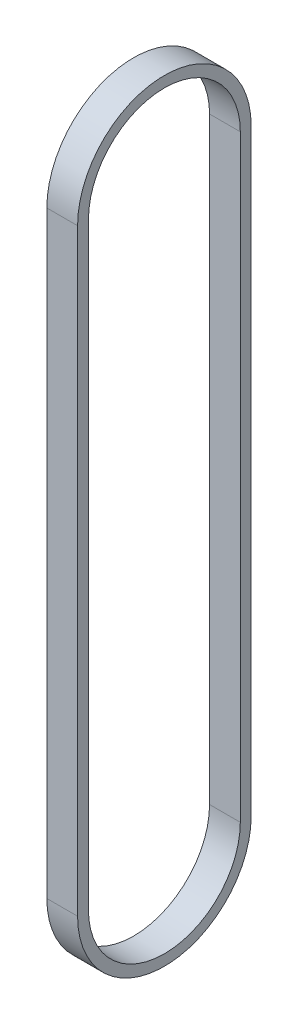
ISO-10303-21;
HEADER;
FILE_DESCRIPTION(('STEP AP214'),'2;1');
FILE_NAME('part.step','',(''),(''),'','','');
FILE_SCHEMA(('AUTOMOTIVE_DESIGN { 1 0 10303 214 1 1 1 1 }'));
ENDSEC;
DATA;
#1=APPLICATION_CONTEXT('core data for automotive mechanical design processes');
#2=APPLICATION_PROTOCOL_DEFINITION('international standard','automotive_design',2000,#1);
#3=PRODUCT_CONTEXT('',#1,'mechanical');
#4=PRODUCT('Part','Part','',(#3));
#5=PRODUCT_RELATED_PRODUCT_CATEGORY('part','',(#4));
#6=PRODUCT_DEFINITION_FORMATION('','',#4);
#7=PRODUCT_DEFINITION_CONTEXT('part definition',#1,'design');
#8=PRODUCT_DEFINITION('design','',#6,#7);
#9=PRODUCT_DEFINITION_SHAPE('','',#8);
#10=(LENGTH_UNIT() NAMED_UNIT(*) SI_UNIT(.MILLI.,.METRE.));
#11=(NAMED_UNIT(*) PLANE_ANGLE_UNIT() SI_UNIT($,.RADIAN.));
#12=(NAMED_UNIT(*) SI_UNIT($,.STERADIAN.) SOLID_ANGLE_UNIT());
#13=UNCERTAINTY_MEASURE_WITH_UNIT(LENGTH_MEASURE(1.E-05),#10,'distance_accuracy_value','');
#14=(GEOMETRIC_REPRESENTATION_CONTEXT(3) GLOBAL_UNCERTAINTY_ASSIGNED_CONTEXT((#13)) GLOBAL_UNIT_ASSIGNED_CONTEXT((#10,
#11,#12)) REPRESENTATION_CONTEXT('',''));
#15=CARTESIAN_POINT('',(0.,0.,0.));
#16=DIRECTION('',(0.,0.,1.));
#17=DIRECTION('',(1.,0.,0.));
#18=AXIS2_PLACEMENT_3D('',#15,#16,#17);
#19=CARTESIAN_POINT('',(9.,175.02378,0.));
#20=DIRECTION('',(-1.,0.,0.));
#21=DIRECTION('',(0.,0.,1.));
#22=AXIS2_PLACEMENT_3D('',#19,#20,#21);
#23=PLANE('',#22);
#24=CARTESIAN_POINT('',(9.,175.02378,0.));
#25=DIRECTION('',(1.,0.,0.));
#26=DIRECTION('',(0.,0.,1.));
#27=AXIS2_PLACEMENT_3D('',#24,#25,#26);
#28=CIRCLE('',#27,25.4);
#29=CARTESIAN_POINT('',(9.,175.02378,-25.4));
#30=VERTEX_POINT('',#29);
#31=CARTESIAN_POINT('',(9.,175.02378,25.4));
#32=VERTEX_POINT('',#31);
#33=EDGE_CURVE('E133',#30,#32,#28,.T.);
#34=ORIENTED_EDGE('',*,*,#33,.T.);
#35=DIRECTION('',(0.,-1.,0.));
#36=VECTOR('',#35,1.);
#37=CARTESIAN_POINT('',(9.,0.,25.4));
#38=LINE('',#37,#36);
#39=CARTESIAN_POINT('',(9.,0.,25.4));
#40=VERTEX_POINT('',#39);
#41=EDGE_CURVE('E136',#32,#40,#38,.T.);
#42=ORIENTED_EDGE('',*,*,#41,.T.);
#43=CARTESIAN_POINT('',(9.,0.,0.));
#44=DIRECTION('',(1.,0.,0.));
#45=DIRECTION('',(0.,0.,-1.));
#46=AXIS2_PLACEMENT_3D('',#43,#44,#45);
#47=CIRCLE('',#46,25.4);
#48=CARTESIAN_POINT('',(9.,0.,-25.4));
#49=VERTEX_POINT('',#48);
#50=EDGE_CURVE('E139',#40,#49,#47,.T.);
#51=ORIENTED_EDGE('',*,*,#50,.T.);
#52=DIRECTION('',(0.,1.,0.));
#53=VECTOR('',#52,1.);
#54=CARTESIAN_POINT('',(9.,175.02378,-25.4));
#55=LINE('',#54,#53);
#56=EDGE_CURVE('E141',#49,#30,#55,.T.);
#57=ORIENTED_EDGE('',*,*,#56,.T.);
#58=EDGE_LOOP('',(#34,#42,#51,#57));
#59=FACE_BOUND('',#58,.T.);
#60=CARTESIAN_POINT('',(9.,175.02378,0.));
#61=DIRECTION('',(1.,0.,0.));
#62=DIRECTION('',(0.,0.,1.));
#63=AXIS2_PLACEMENT_3D('',#60,#61,#62);
#64=CIRCLE('',#63,22.225);
#65=CARTESIAN_POINT('',(9.,175.02378,-22.225));
#66=VERTEX_POINT('',#65);
#67=CARTESIAN_POINT('',(9.,175.02378,22.225));
#68=VERTEX_POINT('',#67);
#69=EDGE_CURVE('E97',#66,#68,#64,.T.);
#70=ORIENTED_EDGE('',*,*,#69,.F.);
#71=DIRECTION('',(0.,1.,0.));
#72=VECTOR('',#71,1.);
#73=CARTESIAN_POINT('',(9.,175.02378,-22.225));
#74=LINE('',#73,#72);
#75=CARTESIAN_POINT('',(9.,0.,-22.2250000000001));
#76=VERTEX_POINT('',#75);
#77=EDGE_CURVE('E119',#76,#66,#74,.T.);
#78=ORIENTED_EDGE('',*,*,#77,.F.);
#79=CARTESIAN_POINT('',(9.,0.,0.));
#80=DIRECTION('',(1.,0.,0.));
#81=DIRECTION('',(0.,0.,-1.));
#82=AXIS2_PLACEMENT_3D('',#79,#80,#81);
#83=CIRCLE('',#82,22.225);
#84=CARTESIAN_POINT('',(9.,0.,22.225));
#85=VERTEX_POINT('',#84);
#86=EDGE_CURVE('E117',#85,#76,#83,.T.);
#87=ORIENTED_EDGE('',*,*,#86,.F.);
#88=DIRECTION('',(0.,-1.,0.));
#89=VECTOR('',#88,1.);
#90=CARTESIAN_POINT('',(9.,0.,22.225));
#91=LINE('',#90,#89);
#92=EDGE_CURVE('E105',#68,#85,#91,.T.);
#93=ORIENTED_EDGE('',*,*,#92,.F.);
#94=EDGE_LOOP('',(#70,#78,#87,#93));
#95=FACE_BOUND('',#94,.T.);
#96=ADVANCED_FACE('F32',(#59,#95),#23,.F.);
#97=CARTESIAN_POINT('',(0.,175.02378,0.));
#98=DIRECTION('',(-1.,0.,0.));
#99=DIRECTION('',(0.,0.,1.));
#100=AXIS2_PLACEMENT_3D('',#97,#98,#99);
#101=PLANE('',#100);
#102=CARTESIAN_POINT('',(0.,175.02378,0.));
#103=DIRECTION('',(1.,0.,0.));
#104=DIRECTION('',(0.,0.,1.));
#105=AXIS2_PLACEMENT_3D('',#102,#103,#104);
#106=CIRCLE('',#105,25.4);
#107=CARTESIAN_POINT('',(0.,175.02378,-25.4));
#108=VERTEX_POINT('',#107);
#109=CARTESIAN_POINT('',(0.,175.02378,25.4));
#110=VERTEX_POINT('',#109);
#111=EDGE_CURVE('E113',#108,#110,#106,.T.);
#112=ORIENTED_EDGE('',*,*,#111,.F.);
#113=DIRECTION('',(0.,1.,0.));
#114=VECTOR('',#113,1.);
#115=CARTESIAN_POINT('',(0.,175.02378,-25.4));
#116=LINE('',#115,#114);
#117=CARTESIAN_POINT('',(0.,0.,-25.4));
#118=VERTEX_POINT('',#117);
#119=EDGE_CURVE('E137',#118,#108,#116,.T.);
#120=ORIENTED_EDGE('',*,*,#119,.F.);
#121=CARTESIAN_POINT('',(0.,0.,0.));
#122=DIRECTION('',(1.,0.,0.));
#123=DIRECTION('',(0.,0.,-1.));
#124=AXIS2_PLACEMENT_3D('',#121,#122,#123);
#125=CIRCLE('',#124,25.4);
#126=CARTESIAN_POINT('',(0.,0.,25.4));
#127=VERTEX_POINT('',#126);
#128=EDGE_CURVE('E148',#127,#118,#125,.T.);
#129=ORIENTED_EDGE('',*,*,#128,.F.);
#130=DIRECTION('',(0.,-1.,0.));
#131=VECTOR('',#130,1.);
#132=CARTESIAN_POINT('',(0.,0.,25.4));
#133=LINE('',#132,#131);
#134=EDGE_CURVE('E146',#110,#127,#133,.T.);
#135=ORIENTED_EDGE('',*,*,#134,.F.);
#136=EDGE_LOOP('',(#112,#120,#129,#135));
#137=FACE_BOUND('',#136,.T.);
#138=DIRECTION('',(0.,1.,0.));
#139=VECTOR('',#138,1.);
#140=CARTESIAN_POINT('',(0.,175.02378,-22.225));
#141=LINE('',#140,#139);
#142=CARTESIAN_POINT('',(0.,0.,-22.2250000000001));
#143=VERTEX_POINT('',#142);
#144=CARTESIAN_POINT('',(0.,175.02378,-22.225));
#145=VERTEX_POINT('',#144);
#146=EDGE_CURVE('E106',#143,#145,#141,.T.);
#147=ORIENTED_EDGE('',*,*,#146,.T.);
#148=CARTESIAN_POINT('',(0.,175.02378,0.));
#149=DIRECTION('',(1.,0.,0.));
#150=DIRECTION('',(0.,0.,1.));
#151=AXIS2_PLACEMENT_3D('',#148,#149,#150);
#152=CIRCLE('',#151,22.225);
#153=CARTESIAN_POINT('',(0.,175.02378,22.225));
#154=VERTEX_POINT('',#153);
#155=EDGE_CURVE('E55',#145,#154,#152,.T.);
#156=ORIENTED_EDGE('',*,*,#155,.T.);
#157=DIRECTION('',(0.,-1.,0.));
#158=VECTOR('',#157,1.);
#159=CARTESIAN_POINT('',(0.,0.,22.225));
#160=LINE('',#159,#158);
#161=CARTESIAN_POINT('',(0.,0.,22.225));
#162=VERTEX_POINT('',#161);
#163=EDGE_CURVE('E112',#154,#162,#160,.T.);
#164=ORIENTED_EDGE('',*,*,#163,.T.);
#165=CARTESIAN_POINT('',(0.,0.,0.));
#166=DIRECTION('',(1.,0.,0.));
#167=DIRECTION('',(0.,0.,-1.));
#168=AXIS2_PLACEMENT_3D('',#165,#166,#167);
#169=CIRCLE('',#168,22.225);
#170=EDGE_CURVE('E125',#162,#143,#169,.T.);
#171=ORIENTED_EDGE('',*,*,#170,.T.);
#172=EDGE_LOOP('',(#147,#156,#164,#171));
#173=FACE_BOUND('',#172,.T.);
#174=ADVANCED_FACE('F166',(#137,#173),#101,.T.);
#175=CARTESIAN_POINT('',(9.,175.02378,0.));
#176=DIRECTION('',(-1.,0.,0.));
#177=DIRECTION('',(0.,0.,1.));
#178=AXIS2_PLACEMENT_3D('',#175,#176,#177);
#179=CYLINDRICAL_SURFACE('',#178,25.4);
#180=ORIENTED_EDGE('',*,*,#111,.T.);
#181=DIRECTION('',(-1.,0.,0.));
#182=VECTOR('',#181,1.);
#183=CARTESIAN_POINT('',(9.,175.02378,25.4));
#184=LINE('',#183,#182);
#185=EDGE_CURVE('E11',#32,#110,#184,.T.);
#186=ORIENTED_EDGE('',*,*,#185,.F.);
#187=ORIENTED_EDGE('',*,*,#33,.F.);
#188=DIRECTION('',(-1.,0.,0.));
#189=VECTOR('',#188,1.);
#190=CARTESIAN_POINT('',(9.,175.02378,-25.4));
#191=LINE('',#190,#189);
#192=EDGE_CURVE('E143',#30,#108,#191,.T.);
#193=ORIENTED_EDGE('',*,*,#192,.T.);
#194=EDGE_LOOP('',(#180,#186,#187,#193));
#195=FACE_BOUND('',#194,.T.);
#196=ADVANCED_FACE('F34',(#195),#179,.T.);
#197=CARTESIAN_POINT('',(9.,0.,25.4));
#198=DIRECTION('',(0.,0.,-1.));
#199=DIRECTION('',(-1.,0.,0.));
#200=AXIS2_PLACEMENT_3D('',#197,#198,#199);
#201=PLANE('',#200);
#202=ORIENTED_EDGE('',*,*,#134,.T.);
#203=DIRECTION('',(-1.,0.,0.));
#204=VECTOR('',#203,1.);
#205=CARTESIAN_POINT('',(9.,0.,25.4));
#206=LINE('',#205,#204);
#207=EDGE_CURVE('E40',#40,#127,#206,.T.);
#208=ORIENTED_EDGE('',*,*,#207,.F.);
#209=ORIENTED_EDGE('',*,*,#41,.F.);
#210=ORIENTED_EDGE('',*,*,#185,.T.);
#211=EDGE_LOOP('',(#202,#208,#209,#210));
#212=FACE_BOUND('',#211,.T.);
#213=ADVANCED_FACE('F176',(#212),#201,.F.);
#214=CARTESIAN_POINT('',(9.,0.,0.));
#215=DIRECTION('',(-1.,0.,0.));
#216=DIRECTION('',(0.,0.,1.));
#217=AXIS2_PLACEMENT_3D('',#214,#215,#216);
#218=CYLINDRICAL_SURFACE('',#217,25.4);
#219=ORIENTED_EDGE('',*,*,#128,.T.);
#220=DIRECTION('',(-1.,0.,0.));
#221=VECTOR('',#220,1.);
#222=CARTESIAN_POINT('',(9.,0.,-25.4));
#223=LINE('',#222,#221);
#224=EDGE_CURVE('E153',#49,#118,#223,.T.);
#225=ORIENTED_EDGE('',*,*,#224,.F.);
#226=ORIENTED_EDGE('',*,*,#50,.F.);
#227=ORIENTED_EDGE('',*,*,#207,.T.);
#228=EDGE_LOOP('',(#219,#225,#226,#227));
#229=FACE_BOUND('',#228,.T.);
#230=ADVANCED_FACE('F160',(#229),#218,.T.);
#231=CARTESIAN_POINT('',(9.,175.02378,-25.4));
#232=DIRECTION('',(0.,0.,1.));
#233=DIRECTION('',(0.,-1.,0.));
#234=AXIS2_PLACEMENT_3D('',#231,#232,#233);
#235=PLANE('',#234);
#236=ORIENTED_EDGE('',*,*,#119,.T.);
#237=ORIENTED_EDGE('',*,*,#192,.F.);
#238=ORIENTED_EDGE('',*,*,#56,.F.);
#239=ORIENTED_EDGE('',*,*,#224,.T.);
#240=EDGE_LOOP('',(#236,#237,#238,#239));
#241=FACE_BOUND('',#240,.T.);
#242=ADVANCED_FACE('F170',(#241),#235,.F.);
#243=CARTESIAN_POINT('',(9.,175.02378,0.));
#244=DIRECTION('',(-1.,0.,0.));
#245=DIRECTION('',(0.,0.,1.));
#246=AXIS2_PLACEMENT_3D('',#243,#244,#245);
#247=CYLINDRICAL_SURFACE('',#246,22.225);
#248=ORIENTED_EDGE('',*,*,#155,.F.);
#249=DIRECTION('',(-1.,0.,0.));
#250=VECTOR('',#249,1.);
#251=CARTESIAN_POINT('',(9.,175.02378,-22.225));
#252=LINE('',#251,#250);
#253=EDGE_CURVE('E101',#66,#145,#252,.T.);
#254=ORIENTED_EDGE('',*,*,#253,.F.);
#255=ORIENTED_EDGE('',*,*,#69,.T.);
#256=DIRECTION('',(-1.,0.,0.));
#257=VECTOR('',#256,1.);
#258=CARTESIAN_POINT('',(9.,175.02378,22.225));
#259=LINE('',#258,#257);
#260=EDGE_CURVE('E100',#68,#154,#259,.T.);
#261=ORIENTED_EDGE('',*,*,#260,.T.);
#262=EDGE_LOOP('',(#248,#254,#255,#261));
#263=FACE_BOUND('',#262,.T.);
#264=ADVANCED_FACE('F99',(#263),#247,.F.);
#265=CARTESIAN_POINT('',(9.,0.,22.225));
#266=DIRECTION('',(0.,0.,-1.));
#267=DIRECTION('',(-1.,0.,0.));
#268=AXIS2_PLACEMENT_3D('',#265,#266,#267);
#269=PLANE('',#268);
#270=ORIENTED_EDGE('',*,*,#163,.F.);
#271=ORIENTED_EDGE('',*,*,#260,.F.);
#272=ORIENTED_EDGE('',*,*,#92,.T.);
#273=DIRECTION('',(-1.,0.,0.));
#274=VECTOR('',#273,1.);
#275=CARTESIAN_POINT('',(9.,0.,22.225));
#276=LINE('',#275,#274);
#277=EDGE_CURVE('E114',#85,#162,#276,.T.);
#278=ORIENTED_EDGE('',*,*,#277,.T.);
#279=EDGE_LOOP('',(#270,#271,#272,#278));
#280=FACE_BOUND('',#279,.T.);
#281=ADVANCED_FACE('F109',(#280),#269,.T.);
#282=CARTESIAN_POINT('',(9.,0.,0.));
#283=DIRECTION('',(-1.,0.,0.));
#284=DIRECTION('',(0.,0.,1.));
#285=AXIS2_PLACEMENT_3D('',#282,#283,#284);
#286=CYLINDRICAL_SURFACE('',#285,22.225);
#287=ORIENTED_EDGE('',*,*,#170,.F.);
#288=ORIENTED_EDGE('',*,*,#277,.F.);
#289=ORIENTED_EDGE('',*,*,#86,.T.);
#290=DIRECTION('',(-1.,0.,0.));
#291=VECTOR('',#290,1.);
#292=CARTESIAN_POINT('',(9.,0.,-22.2250000000001));
#293=LINE('',#292,#291);
#294=EDGE_CURVE('E47',#76,#143,#293,.T.);
#295=ORIENTED_EDGE('',*,*,#294,.T.);
#296=EDGE_LOOP('',(#287,#288,#289,#295));
#297=FACE_BOUND('',#296,.T.);
#298=ADVANCED_FACE('F199',(#297),#286,.F.);
#299=CARTESIAN_POINT('',(9.,175.02378,-22.225));
#300=DIRECTION('',(0.,0.,1.));
#301=DIRECTION('',(0.,-1.,0.));
#302=AXIS2_PLACEMENT_3D('',#299,#300,#301);
#303=PLANE('',#302);
#304=ORIENTED_EDGE('',*,*,#146,.F.);
#305=ORIENTED_EDGE('',*,*,#294,.F.);
#306=ORIENTED_EDGE('',*,*,#77,.T.);
#307=ORIENTED_EDGE('',*,*,#253,.T.);
#308=EDGE_LOOP('',(#304,#305,#306,#307));
#309=FACE_BOUND('',#308,.T.);
#310=ADVANCED_FACE('F203',(#309),#303,.T.);
#311=CLOSED_SHELL('',(#96,#174,#196,#213,#230,#242,#264,#281,#298,#310));
#312=MANIFOLD_SOLID_BREP('B2',#311);
#313=ADVANCED_BREP_SHAPE_REPRESENTATION('',(#18,#312),#14);
#314=SHAPE_DEFINITION_REPRESENTATION(#9,#313);
ENDSEC;
END-ISO-10303-21;
